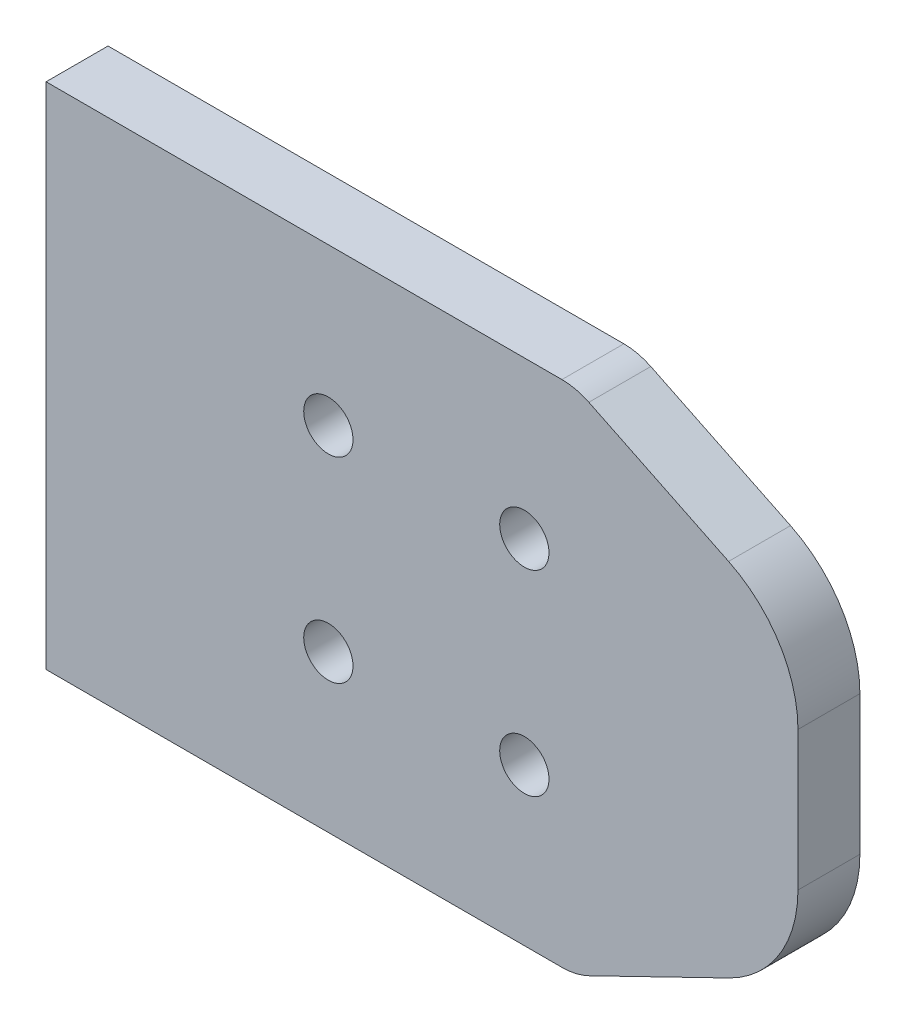
ISO-10303-21;
HEADER;
FILE_DESCRIPTION(('STEP AP214'),'2;1');
FILE_NAME('part.step','',(''),(''),'','','');
FILE_SCHEMA(('AUTOMOTIVE_DESIGN { 1 0 10303 214 1 1 1 1 }'));
ENDSEC;
DATA;
#1=APPLICATION_CONTEXT('core data for automotive mechanical design processes');
#2=APPLICATION_PROTOCOL_DEFINITION('international standard','automotive_design',2000,#1);
#3=PRODUCT_CONTEXT('',#1,'mechanical');
#4=PRODUCT('Part','Part','',(#3));
#5=PRODUCT_RELATED_PRODUCT_CATEGORY('part','',(#4));
#6=PRODUCT_DEFINITION_FORMATION('','',#4);
#7=PRODUCT_DEFINITION_CONTEXT('part definition',#1,'design');
#8=PRODUCT_DEFINITION('design','',#6,#7);
#9=PRODUCT_DEFINITION_SHAPE('','',#8);
#10=(LENGTH_UNIT() NAMED_UNIT(*) SI_UNIT(.MILLI.,.METRE.));
#11=(NAMED_UNIT(*) PLANE_ANGLE_UNIT() SI_UNIT($,.RADIAN.));
#12=(NAMED_UNIT(*) SI_UNIT($,.STERADIAN.) SOLID_ANGLE_UNIT());
#13=UNCERTAINTY_MEASURE_WITH_UNIT(LENGTH_MEASURE(1.E-05),#10,'distance_accuracy_value','');
#14=(GEOMETRIC_REPRESENTATION_CONTEXT(3) GLOBAL_UNCERTAINTY_ASSIGNED_CONTEXT((#13)) GLOBAL_UNIT_ASSIGNED_CONTEXT((#10,
#11,#12)) REPRESENTATION_CONTEXT('',''));
#15=CARTESIAN_POINT('',(0.,0.,0.));
#16=DIRECTION('',(0.,0.,1.));
#17=DIRECTION('',(1.,0.,0.));
#18=AXIS2_PLACEMENT_3D('',#15,#16,#17);
#19=CARTESIAN_POINT('',(-90.9413983771939,34.3761920714684,10.05));
#20=DIRECTION('',(1.,0.,0.));
#21=DIRECTION('',(0.,0.,-1.));
#22=AXIS2_PLACEMENT_3D('',#19,#20,#21);
#23=PLANE('',#22);
#24=DIRECTION('',(0.,-1.,0.));
#25=VECTOR('',#24,1.);
#26=CARTESIAN_POINT('',(-90.9413983771939,34.3761920714684,0.));
#27=LINE('',#26,#25);
#28=CARTESIAN_POINT('',(-90.9413983771939,34.3761920714684,0.));
#29=VERTEX_POINT('',#28);
#30=CARTESIAN_POINT('',(-90.9413983771939,-48.2238079285316,0.));
#31=VERTEX_POINT('',#30);
#32=EDGE_CURVE('E135',#29,#31,#27,.T.);
#33=ORIENTED_EDGE('',*,*,#32,.T.);
#34=DIRECTION('',(0.,0.,-1.));
#35=VECTOR('',#34,1.);
#36=CARTESIAN_POINT('',(-90.9413983771939,-48.2238079285316,10.05));
#37=LINE('',#36,#35);
#38=CARTESIAN_POINT('',(-90.9413983771939,-48.2238079285316,10.05));
#39=VERTEX_POINT('',#38);
#40=EDGE_CURVE('E116',#39,#31,#37,.T.);
#41=ORIENTED_EDGE('',*,*,#40,.F.);
#42=DIRECTION('',(0.,-1.,0.));
#43=VECTOR('',#42,1.);
#44=CARTESIAN_POINT('',(-90.9413983771939,34.3761920714684,10.05));
#45=LINE('',#44,#43);
#46=CARTESIAN_POINT('',(-90.9413983771939,34.3761920714684,10.05));
#47=VERTEX_POINT('',#46);
#48=EDGE_CURVE('E122',#47,#39,#45,.T.);
#49=ORIENTED_EDGE('',*,*,#48,.F.);
#50=DIRECTION('',(0.,0.,-1.));
#51=VECTOR('',#50,1.);
#52=CARTESIAN_POINT('',(-90.9413983771939,34.3761920714684,10.05));
#53=LINE('',#52,#51);
#54=EDGE_CURVE('E137',#47,#29,#53,.T.);
#55=ORIENTED_EDGE('',*,*,#54,.T.);
#56=EDGE_LOOP('',(#33,#41,#49,#55));
#57=FACE_BOUND('',#56,.T.);
#58=ADVANCED_FACE('F31',(#57),#23,.F.);
#59=CARTESIAN_POINT('',(-90.9413983771939,-48.2238079285316,10.05));
#60=DIRECTION('',(0.,1.,0.));
#61=DIRECTION('',(0.,0.,1.));
#62=AXIS2_PLACEMENT_3D('',#59,#60,#61);
#63=PLANE('',#62);
#64=DIRECTION('',(1.,0.,0.));
#65=VECTOR('',#64,1.);
#66=CARTESIAN_POINT('',(-90.9413983771939,-48.2238079285316,0.));
#67=LINE('',#66,#65);
#68=CARTESIAN_POINT('',(-7.2431784453373,-48.2238079285316,0.));
#69=VERTEX_POINT('',#68);
#70=EDGE_CURVE('E222',#31,#69,#67,.T.);
#71=ORIENTED_EDGE('',*,*,#70,.T.);
#72=DIRECTION('',(0.,0.,-1.));
#73=VECTOR('',#72,1.);
#74=CARTESIAN_POINT('',(-7.2431784453373,-48.2238079285316,10.05));
#75=LINE('',#74,#73);
#76=CARTESIAN_POINT('',(-7.2431784453373,-48.2238079285316,10.05));
#77=VERTEX_POINT('',#76);
#78=EDGE_CURVE('E119',#69,#77,#75,.F.);
#79=ORIENTED_EDGE('',*,*,#78,.T.);
#80=DIRECTION('',(1.,0.,0.));
#81=VECTOR('',#80,1.);
#82=CARTESIAN_POINT('',(-90.9413983771939,-48.2238079285316,10.05));
#83=LINE('',#82,#81);
#84=EDGE_CURVE('E111',#39,#77,#83,.T.);
#85=ORIENTED_EDGE('',*,*,#84,.F.);
#86=ORIENTED_EDGE('',*,*,#40,.T.);
#87=EDGE_LOOP('',(#71,#79,#85,#86));
#88=FACE_BOUND('',#87,.T.);
#89=ADVANCED_FACE('F114',(#88),#63,.F.);
#90=CARTESIAN_POINT('',(31.058601622806,34.3761920714684,10.05));
#91=DIRECTION('',(-1.,0.,0.));
#92=DIRECTION('',(0.,-1.,0.));
#93=AXIS2_PLACEMENT_3D('',#90,#91,#92);
#94=PLANE('',#93);
#95=DIRECTION('',(0.,1.,0.));
#96=VECTOR('',#95,1.);
#97=CARTESIAN_POINT('',(31.058601622806,34.3761920714684,10.05));
#98=LINE('',#97,#96);
#99=CARTESIAN_POINT('',(31.0586016228061,-18.2081884178366,10.05));
#100=VERTEX_POINT('',#99);
#101=CARTESIAN_POINT('',(31.0586016228061,4.36057256077351,10.05));
#102=VERTEX_POINT('',#101);
#103=EDGE_CURVE('E121',#100,#102,#98,.T.);
#104=ORIENTED_EDGE('',*,*,#103,.F.);
#105=DIRECTION('',(0.,0.,-1.));
#106=VECTOR('',#105,1.);
#107=CARTESIAN_POINT('',(31.0586016228061,-18.2081884178366,10.05));
#108=LINE('',#107,#106);
#109=CARTESIAN_POINT('',(31.0586016228061,-18.2081884178366,0.));
#110=VERTEX_POINT('',#109);
#111=EDGE_CURVE('E162',#100,#110,#108,.T.);
#112=ORIENTED_EDGE('',*,*,#111,.T.);
#113=DIRECTION('',(0.,1.,0.));
#114=VECTOR('',#113,1.);
#115=CARTESIAN_POINT('',(31.058601622806,34.3761920714684,0.));
#116=LINE('',#115,#114);
#117=CARTESIAN_POINT('',(31.0586016228061,4.36057256077351,0.));
#118=VERTEX_POINT('',#117);
#119=EDGE_CURVE('E186',#110,#118,#116,.T.);
#120=ORIENTED_EDGE('',*,*,#119,.T.);
#121=DIRECTION('',(0.,0.,-1.));
#122=VECTOR('',#121,1.);
#123=CARTESIAN_POINT('',(31.0586016228061,4.3605725607735,10.05));
#124=LINE('',#123,#122);
#125=EDGE_CURVE('E160',#118,#102,#124,.F.);
#126=ORIENTED_EDGE('',*,*,#125,.T.);
#127=EDGE_LOOP('',(#104,#112,#120,#126));
#128=FACE_BOUND('',#127,.T.);
#129=ADVANCED_FACE('F176',(#128),#94,.F.);
#130=CARTESIAN_POINT('',(-90.9413983771939,34.3761920714684,10.05));
#131=DIRECTION('',(0.,-1.,0.));
#132=DIRECTION('',(0.,0.,-1.));
#133=AXIS2_PLACEMENT_3D('',#130,#131,#132);
#134=PLANE('',#133);
#135=DIRECTION('',(-1.,0.,0.));
#136=VECTOR('',#135,1.);
#137=CARTESIAN_POINT('',(-90.9413983771939,34.3761920714684,10.05));
#138=LINE('',#137,#136);
#139=CARTESIAN_POINT('',(-7.24317844533733,34.3761920714684,10.05));
#140=VERTEX_POINT('',#139);
#141=EDGE_CURVE('E128',#140,#47,#138,.T.);
#142=ORIENTED_EDGE('',*,*,#141,.F.);
#143=DIRECTION('',(0.,0.,-1.));
#144=VECTOR('',#143,1.);
#145=CARTESIAN_POINT('',(-7.2431784453373,34.3761920714684,10.05));
#146=LINE('',#145,#144);
#147=CARTESIAN_POINT('',(-7.24317844533733,34.3761920714684,0.));
#148=VERTEX_POINT('',#147);
#149=EDGE_CURVE('E154',#140,#148,#146,.T.);
#150=ORIENTED_EDGE('',*,*,#149,.T.);
#151=DIRECTION('',(-1.,0.,0.));
#152=VECTOR('',#151,1.);
#153=CARTESIAN_POINT('',(-90.9413983771939,34.3761920714684,0.));
#154=LINE('',#153,#152);
#155=EDGE_CURVE('E132',#148,#29,#154,.T.);
#156=ORIENTED_EDGE('',*,*,#155,.T.);
#157=ORIENTED_EDGE('',*,*,#54,.F.);
#158=EDGE_LOOP('',(#142,#150,#156,#157));
#159=FACE_BOUND('',#158,.T.);
#160=ADVANCED_FACE('F226',(#159),#134,.F.);
#161=CARTESIAN_POINT('',(-90.9413983771939,-48.2238079285316,10.05));
#162=DIRECTION('',(0.,0.,1.));
#163=DIRECTION('',(1.,0.,0.));
#164=AXIS2_PLACEMENT_3D('',#161,#162,#163);
#165=PLANE('',#164);
#166=DIRECTION('',(0.899367854138262,0.437192706872767,0.));
#167=VECTOR('',#166,1.);
#168=CARTESIAN_POINT('',(-4.94139837719395,-48.2238079285316,10.05));
#169=LINE('',#168,#167);
#170=CARTESIAN_POINT('',(-2.87125137660963,-47.2174864699142,10.05));
#171=VERTEX_POINT('',#170);
#172=CARTESIAN_POINT('',(19.8024557602614,-36.1955455006019,10.05));
#173=VERTEX_POINT('',#172);
#174=EDGE_CURVE('E172',#171,#173,#169,.T.);
#175=ORIENTED_EDGE('',*,*,#174,.T.);
#176=CARTESIAN_POINT('',(11.0586016228061,-18.2081884178366,10.05));
#177=DIRECTION('',(0.,0.,1.));
#178=DIRECTION('',(1.,0.,0.));
#179=AXIS2_PLACEMENT_3D('',#176,#177,#178);
#180=CIRCLE('',#179,20.);
#181=EDGE_CURVE('E39',#173,#100,#180,.T.);
#182=ORIENTED_EDGE('',*,*,#181,.T.);
#183=ORIENTED_EDGE('',*,*,#103,.T.);
#184=CARTESIAN_POINT('',(11.0586016228061,4.3605725607735,10.05));
#185=DIRECTION('',(0.,0.,1.));
#186=DIRECTION('',(1.,0.,0.));
#187=AXIS2_PLACEMENT_3D('',#184,#185,#186);
#188=CIRCLE('',#187,20.);
#189=CARTESIAN_POINT('',(19.8024557602614,22.3479296435388,10.05));
#190=VERTEX_POINT('',#189);
#191=EDGE_CURVE('E46',#102,#190,#188,.T.);
#192=ORIENTED_EDGE('',*,*,#191,.T.);
#193=DIRECTION('',(-0.899367854138262,0.437192706872767,0.));
#194=VECTOR('',#193,1.);
#195=CARTESIAN_POINT('',(-4.94139837719395,34.3761920714684,10.05));
#196=LINE('',#195,#194);
#197=CARTESIAN_POINT('',(-2.87125137660963,33.3698706128511,10.05));
#198=VERTEX_POINT('',#197);
#199=EDGE_CURVE('E193',#190,#198,#196,.T.);
#200=ORIENTED_EDGE('',*,*,#199,.T.);
#201=CARTESIAN_POINT('',(-7.2431784453373,24.3761920714684,10.05));
#202=DIRECTION('',(0.,0.,1.));
#203=DIRECTION('',(1.,0.,0.));
#204=AXIS2_PLACEMENT_3D('',#201,#202,#203);
#205=CIRCLE('',#204,10.);
#206=EDGE_CURVE('E150',#198,#140,#205,.T.);
#207=ORIENTED_EDGE('',*,*,#206,.T.);
#208=ORIENTED_EDGE('',*,*,#141,.T.);
#209=ORIENTED_EDGE('',*,*,#48,.T.);
#210=ORIENTED_EDGE('',*,*,#84,.T.);
#211=CARTESIAN_POINT('',(-7.2431784453373,-38.2238079285316,10.05));
#212=DIRECTION('',(0.,0.,1.));
#213=DIRECTION('',(1.,0.,0.));
#214=AXIS2_PLACEMENT_3D('',#211,#212,#213);
#215=CIRCLE('',#214,10.);
#216=EDGE_CURVE('E152',#77,#171,#215,.T.);
#217=ORIENTED_EDGE('',*,*,#216,.T.);
#218=EDGE_LOOP('',(#175,#182,#183,#192,#200,#207,#208,#209,#210,#217));
#219=FACE_BOUND('',#218,.T.);
#220=CARTESIAN_POINT('',(-13.3413983771939,-22.8238079285316,10.05));
#221=DIRECTION('',(0.,0.,-1.));
#222=DIRECTION('',(-1.,0.,0.));
#223=AXIS2_PLACEMENT_3D('',#220,#221,#222);
#224=CIRCLE('',#223,4.);
#225=CARTESIAN_POINT('',(-17.3413983771939,-22.8238079285316,10.05));
#226=VERTEX_POINT('',#225);
#227=EDGE_CURVE('E197',#226,#226,#224,.T.);
#228=ORIENTED_EDGE('',*,*,#227,.T.);
#229=EDGE_LOOP('',(#228));
#230=FACE_BOUND('',#229,.T.);
#231=CARTESIAN_POINT('',(-13.3413983771939,8.97619207146843,10.05));
#232=DIRECTION('',(0.,0.,-1.));
#233=DIRECTION('',(-1.,0.,0.));
#234=AXIS2_PLACEMENT_3D('',#231,#232,#233);
#235=CIRCLE('',#234,4.);
#236=CARTESIAN_POINT('',(-17.3413983771939,8.97619207146843,10.05));
#237=VERTEX_POINT('',#236);
#238=EDGE_CURVE('E203',#237,#237,#235,.T.);
#239=ORIENTED_EDGE('',*,*,#238,.T.);
#240=EDGE_LOOP('',(#239));
#241=FACE_BOUND('',#240,.T.);
#242=CARTESIAN_POINT('',(-45.1413983771939,-22.8238079285316,10.05));
#243=DIRECTION('',(0.,0.,-1.));
#244=DIRECTION('',(-1.,0.,0.));
#245=AXIS2_PLACEMENT_3D('',#242,#243,#244);
#246=CIRCLE('',#245,4.);
#247=CARTESIAN_POINT('',(-49.1413983771939,-22.8238079285316,10.05));
#248=VERTEX_POINT('',#247);
#249=EDGE_CURVE('E209',#248,#248,#246,.T.);
#250=ORIENTED_EDGE('',*,*,#249,.T.);
#251=EDGE_LOOP('',(#250));
#252=FACE_BOUND('',#251,.T.);
#253=CARTESIAN_POINT('',(-45.1413983771939,8.97619207146843,10.05));
#254=DIRECTION('',(0.,0.,-1.));
#255=DIRECTION('',(-1.,0.,0.));
#256=AXIS2_PLACEMENT_3D('',#253,#254,#255);
#257=CIRCLE('',#256,4.00000000000001);
#258=CARTESIAN_POINT('',(-49.1413983771939,8.97619207146843,10.05));
#259=VERTEX_POINT('',#258);
#260=EDGE_CURVE('E215',#259,#259,#257,.T.);
#261=ORIENTED_EDGE('',*,*,#260,.T.);
#262=EDGE_LOOP('',(#261));
#263=FACE_BOUND('',#262,.T.);
#264=ADVANCED_FACE('F125',(#219,#230,#241,#252,#263),#165,.T.);
#265=CARTESIAN_POINT('',(-90.9413983771939,-48.2238079285316,0.));
#266=DIRECTION('',(0.,0.,1.));
#267=DIRECTION('',(1.,0.,0.));
#268=AXIS2_PLACEMENT_3D('',#265,#266,#267);
#269=PLANE('',#268);
#270=CARTESIAN_POINT('',(-13.3413983771939,-22.8238079285316,0.));
#271=DIRECTION('',(0.,0.,-1.));
#272=DIRECTION('',(-1.,0.,0.));
#273=AXIS2_PLACEMENT_3D('',#270,#271,#272);
#274=CIRCLE('',#273,4.);
#275=CARTESIAN_POINT('',(-17.3413983771939,-22.8238079285316,0.));
#276=VERTEX_POINT('',#275);
#277=EDGE_CURVE('E195',#276,#276,#274,.T.);
#278=ORIENTED_EDGE('',*,*,#277,.F.);
#279=EDGE_LOOP('',(#278));
#280=FACE_BOUND('',#279,.T.);
#281=CARTESIAN_POINT('',(-13.3413983771939,8.97619207146843,0.));
#282=DIRECTION('',(0.,0.,-1.));
#283=DIRECTION('',(-1.,0.,0.));
#284=AXIS2_PLACEMENT_3D('',#281,#282,#283);
#285=CIRCLE('',#284,4.);
#286=CARTESIAN_POINT('',(-17.3413983771939,8.97619207146843,0.));
#287=VERTEX_POINT('',#286);
#288=EDGE_CURVE('E200',#287,#287,#285,.T.);
#289=ORIENTED_EDGE('',*,*,#288,.F.);
#290=EDGE_LOOP('',(#289));
#291=FACE_BOUND('',#290,.T.);
#292=CARTESIAN_POINT('',(-45.1413983771939,-22.8238079285316,0.));
#293=DIRECTION('',(0.,0.,-1.));
#294=DIRECTION('',(-1.,0.,0.));
#295=AXIS2_PLACEMENT_3D('',#292,#293,#294);
#296=CIRCLE('',#295,4.);
#297=CARTESIAN_POINT('',(-49.1413983771939,-22.8238079285316,0.));
#298=VERTEX_POINT('',#297);
#299=EDGE_CURVE('E206',#298,#298,#296,.T.);
#300=ORIENTED_EDGE('',*,*,#299,.F.);
#301=EDGE_LOOP('',(#300));
#302=FACE_BOUND('',#301,.T.);
#303=CARTESIAN_POINT('',(-45.1413983771939,8.97619207146843,0.));
#304=DIRECTION('',(0.,0.,-1.));
#305=DIRECTION('',(-1.,0.,0.));
#306=AXIS2_PLACEMENT_3D('',#303,#304,#305);
#307=CIRCLE('',#306,4.00000000000001);
#308=CARTESIAN_POINT('',(-49.1413983771939,8.97619207146843,0.));
#309=VERTEX_POINT('',#308);
#310=EDGE_CURVE('E212',#309,#309,#307,.T.);
#311=ORIENTED_EDGE('',*,*,#310,.F.);
#312=EDGE_LOOP('',(#311));
#313=FACE_BOUND('',#312,.T.);
#314=ORIENTED_EDGE('',*,*,#119,.F.);
#315=CARTESIAN_POINT('',(11.0586016228061,-18.2081884178366,0.));
#316=DIRECTION('',(0.,0.,1.));
#317=DIRECTION('',(1.,0.,0.));
#318=AXIS2_PLACEMENT_3D('',#315,#316,#317);
#319=CIRCLE('',#318,20.);
#320=CARTESIAN_POINT('',(19.8024557602614,-36.1955455006019,0.));
#321=VERTEX_POINT('',#320);
#322=EDGE_CURVE('E167',#110,#321,#319,.F.);
#323=ORIENTED_EDGE('',*,*,#322,.T.);
#324=DIRECTION('',(0.899367854138262,0.437192706872767,0.));
#325=VECTOR('',#324,1.);
#326=CARTESIAN_POINT('',(-4.94139837719395,-48.2238079285316,0.));
#327=LINE('',#326,#325);
#328=CARTESIAN_POINT('',(-2.87125137660963,-47.2174864699142,0.));
#329=VERTEX_POINT('',#328);
#330=EDGE_CURVE('E185',#329,#321,#327,.T.);
#331=ORIENTED_EDGE('',*,*,#330,.F.);
#332=CARTESIAN_POINT('',(-7.2431784453373,-38.2238079285316,0.));
#333=DIRECTION('',(0.,0.,1.));
#334=DIRECTION('',(1.,0.,0.));
#335=AXIS2_PLACEMENT_3D('',#332,#333,#334);
#336=CIRCLE('',#335,10.);
#337=EDGE_CURVE('E147',#329,#69,#336,.F.);
#338=ORIENTED_EDGE('',*,*,#337,.T.);
#339=ORIENTED_EDGE('',*,*,#70,.F.);
#340=ORIENTED_EDGE('',*,*,#32,.F.);
#341=ORIENTED_EDGE('',*,*,#155,.F.);
#342=CARTESIAN_POINT('',(-7.2431784453373,24.3761920714684,0.));
#343=DIRECTION('',(0.,0.,1.));
#344=DIRECTION('',(1.,0.,0.));
#345=AXIS2_PLACEMENT_3D('',#342,#343,#344);
#346=CIRCLE('',#345,10.);
#347=CARTESIAN_POINT('',(-2.87125137660963,33.3698706128511,0.));
#348=VERTEX_POINT('',#347);
#349=EDGE_CURVE('E140',#148,#348,#346,.F.);
#350=ORIENTED_EDGE('',*,*,#349,.T.);
#351=DIRECTION('',(-0.899367854138262,0.437192706872767,0.));
#352=VECTOR('',#351,1.);
#353=CARTESIAN_POINT('',(-4.94139837719395,34.3761920714684,0.));
#354=LINE('',#353,#352);
#355=CARTESIAN_POINT('',(19.8024557602614,22.3479296435388,0.));
#356=VERTEX_POINT('',#355);
#357=EDGE_CURVE('E190',#356,#348,#354,.T.);
#358=ORIENTED_EDGE('',*,*,#357,.F.);
#359=CARTESIAN_POINT('',(11.0586016228061,4.3605725607735,0.));
#360=DIRECTION('',(0.,0.,1.));
#361=DIRECTION('',(1.,0.,0.));
#362=AXIS2_PLACEMENT_3D('',#359,#360,#361);
#363=CIRCLE('',#362,20.);
#364=EDGE_CURVE('E165',#356,#118,#363,.F.);
#365=ORIENTED_EDGE('',*,*,#364,.T.);
#366=EDGE_LOOP('',(#314,#323,#331,#338,#339,#340,#341,#350,#358,#365));
#367=FACE_BOUND('',#366,.T.);
#368=ADVANCED_FACE('F184',(#280,#291,#302,#313,#367),#269,.F.);
#369=CARTESIAN_POINT('',(-45.1413983771939,8.97619207146843,10.05));
#370=DIRECTION('',(0.,0.,-1.));
#371=DIRECTION('',(-1.,0.,0.));
#372=AXIS2_PLACEMENT_3D('',#369,#370,#371);
#373=CYLINDRICAL_SURFACE('',#372,4.00000000000001);
#374=ORIENTED_EDGE('',*,*,#260,.F.);
#375=EDGE_LOOP('',(#374));
#376=FACE_BOUND('',#375,.T.);
#377=ORIENTED_EDGE('',*,*,#310,.T.);
#378=EDGE_LOOP('',(#377));
#379=FACE_BOUND('',#378,.T.);
#380=ADVANCED_FACE('F254',(#376,#379),#373,.F.);
#381=CARTESIAN_POINT('',(-45.1413983771939,-22.8238079285316,10.05));
#382=DIRECTION('',(0.,0.,-1.));
#383=DIRECTION('',(-1.,0.,0.));
#384=AXIS2_PLACEMENT_3D('',#381,#382,#383);
#385=CYLINDRICAL_SURFACE('',#384,4.);
#386=ORIENTED_EDGE('',*,*,#249,.F.);
#387=EDGE_LOOP('',(#386));
#388=FACE_BOUND('',#387,.T.);
#389=ORIENTED_EDGE('',*,*,#299,.T.);
#390=EDGE_LOOP('',(#389));
#391=FACE_BOUND('',#390,.T.);
#392=ADVANCED_FACE('F260',(#388,#391),#385,.F.);
#393=CARTESIAN_POINT('',(-13.3413983771939,8.97619207146843,10.05));
#394=DIRECTION('',(0.,0.,-1.));
#395=DIRECTION('',(-1.,0.,0.));
#396=AXIS2_PLACEMENT_3D('',#393,#394,#395);
#397=CYLINDRICAL_SURFACE('',#396,4.);
#398=ORIENTED_EDGE('',*,*,#238,.F.);
#399=EDGE_LOOP('',(#398));
#400=FACE_BOUND('',#399,.T.);
#401=ORIENTED_EDGE('',*,*,#288,.T.);
#402=EDGE_LOOP('',(#401));
#403=FACE_BOUND('',#402,.T.);
#404=ADVANCED_FACE('F264',(#400,#403),#397,.F.);
#405=CARTESIAN_POINT('',(-13.3413983771939,-22.8238079285316,10.05));
#406=DIRECTION('',(0.,0.,-1.));
#407=DIRECTION('',(-1.,0.,0.));
#408=AXIS2_PLACEMENT_3D('',#405,#406,#407);
#409=CYLINDRICAL_SURFACE('',#408,4.);
#410=ORIENTED_EDGE('',*,*,#227,.F.);
#411=EDGE_LOOP('',(#410));
#412=FACE_BOUND('',#411,.T.);
#413=ORIENTED_EDGE('',*,*,#277,.T.);
#414=EDGE_LOOP('',(#413));
#415=FACE_BOUND('',#414,.T.);
#416=ADVANCED_FACE('F268',(#412,#415),#409,.F.);
#417=CARTESIAN_POINT('',(-4.94139837719395,34.3761920714684,10.05));
#418=DIRECTION('',(-0.437192706872767,-0.899367854138263,0.));
#419=DIRECTION('',(0.899367854138263,-0.437192706872767,0.));
#420=AXIS2_PLACEMENT_3D('',#417,#418,#419);
#421=PLANE('',#420);
#422=ORIENTED_EDGE('',*,*,#199,.F.);
#423=DIRECTION('',(0.,0.,-1.));
#424=VECTOR('',#423,1.);
#425=CARTESIAN_POINT('',(19.8024557602614,22.3479296435388,10.05));
#426=LINE('',#425,#424);
#427=EDGE_CURVE('E11',#190,#356,#426,.T.);
#428=ORIENTED_EDGE('',*,*,#427,.T.);
#429=ORIENTED_EDGE('',*,*,#357,.T.);
#430=DIRECTION('',(0.,0.,-1.));
#431=VECTOR('',#430,1.);
#432=CARTESIAN_POINT('',(-2.87125137660963,33.3698706128511,10.05));
#433=LINE('',#432,#431);
#434=EDGE_CURVE('E157',#348,#198,#433,.F.);
#435=ORIENTED_EDGE('',*,*,#434,.T.);
#436=EDGE_LOOP('',(#422,#428,#429,#435));
#437=FACE_BOUND('',#436,.T.);
#438=ADVANCED_FACE('F239',(#437),#421,.F.);
#439=CARTESIAN_POINT('',(-4.94139837719395,-48.2238079285316,10.05));
#440=DIRECTION('',(-0.437192706872767,0.899367854138263,0.));
#441=DIRECTION('',(-0.899367854138263,-0.437192706872767,0.));
#442=AXIS2_PLACEMENT_3D('',#439,#440,#441);
#443=PLANE('',#442);
#444=ORIENTED_EDGE('',*,*,#330,.T.);
#445=DIRECTION('',(0.,0.,-1.));
#446=VECTOR('',#445,1.);
#447=CARTESIAN_POINT('',(19.8024557602614,-36.1955455006019,10.05));
#448=LINE('',#447,#446);
#449=EDGE_CURVE('E54',#321,#173,#448,.F.);
#450=ORIENTED_EDGE('',*,*,#449,.T.);
#451=ORIENTED_EDGE('',*,*,#174,.F.);
#452=DIRECTION('',(0.,0.,-1.));
#453=VECTOR('',#452,1.);
#454=CARTESIAN_POINT('',(-2.87125137660963,-47.2174864699142,10.05));
#455=LINE('',#454,#453);
#456=EDGE_CURVE('E136',#171,#329,#455,.T.);
#457=ORIENTED_EDGE('',*,*,#456,.T.);
#458=EDGE_LOOP('',(#444,#450,#451,#457));
#459=FACE_BOUND('',#458,.T.);
#460=ADVANCED_FACE('F187',(#459),#443,.F.);
#461=CARTESIAN_POINT('',(-7.2431784453373,-38.2238079285316,10.05));
#462=DIRECTION('',(0.,0.,-1.));
#463=DIRECTION('',(-1.,0.,0.));
#464=AXIS2_PLACEMENT_3D('',#461,#462,#463);
#465=CYLINDRICAL_SURFACE('',#464,10.);
#466=ORIENTED_EDGE('',*,*,#216,.F.);
#467=ORIENTED_EDGE('',*,*,#78,.F.);
#468=ORIENTED_EDGE('',*,*,#337,.F.);
#469=ORIENTED_EDGE('',*,*,#456,.F.);
#470=EDGE_LOOP('',(#466,#467,#468,#469));
#471=FACE_BOUND('',#470,.T.);
#472=ADVANCED_FACE('F229',(#471),#465,.T.);
#473=CARTESIAN_POINT('',(-7.2431784453373,24.3761920714684,10.05));
#474=DIRECTION('',(0.,0.,-1.));
#475=DIRECTION('',(-1.,0.,0.));
#476=AXIS2_PLACEMENT_3D('',#473,#474,#475);
#477=CYLINDRICAL_SURFACE('',#476,10.);
#478=ORIENTED_EDGE('',*,*,#206,.F.);
#479=ORIENTED_EDGE('',*,*,#434,.F.);
#480=ORIENTED_EDGE('',*,*,#349,.F.);
#481=ORIENTED_EDGE('',*,*,#149,.F.);
#482=EDGE_LOOP('',(#478,#479,#480,#481));
#483=FACE_BOUND('',#482,.T.);
#484=ADVANCED_FACE('F231',(#483),#477,.T.);
#485=CARTESIAN_POINT('',(11.0586016228061,-18.2081884178366,10.05));
#486=DIRECTION('',(0.,0.,-1.));
#487=DIRECTION('',(-1.,0.,0.));
#488=AXIS2_PLACEMENT_3D('',#485,#486,#487);
#489=CYLINDRICAL_SURFACE('',#488,20.);
#490=ORIENTED_EDGE('',*,*,#181,.F.);
#491=ORIENTED_EDGE('',*,*,#449,.F.);
#492=ORIENTED_EDGE('',*,*,#322,.F.);
#493=ORIENTED_EDGE('',*,*,#111,.F.);
#494=EDGE_LOOP('',(#490,#491,#492,#493));
#495=FACE_BOUND('',#494,.T.);
#496=ADVANCED_FACE('F181',(#495),#489,.T.);
#497=CARTESIAN_POINT('',(11.0586016228061,4.3605725607735,10.05));
#498=DIRECTION('',(0.,0.,-1.));
#499=DIRECTION('',(-1.,0.,0.));
#500=AXIS2_PLACEMENT_3D('',#497,#498,#499);
#501=CYLINDRICAL_SURFACE('',#500,20.);
#502=ORIENTED_EDGE('',*,*,#191,.F.);
#503=ORIENTED_EDGE('',*,*,#125,.F.);
#504=ORIENTED_EDGE('',*,*,#364,.F.);
#505=ORIENTED_EDGE('',*,*,#427,.F.);
#506=EDGE_LOOP('',(#502,#503,#504,#505));
#507=FACE_BOUND('',#506,.T.);
#508=ADVANCED_FACE('F33',(#507),#501,.T.);
#509=CLOSED_SHELL('',(#58,#89,#129,#160,#264,#368,#380,#392,#404,#416,#438,#460,#472,#484,#496,#508));
#510=MANIFOLD_SOLID_BREP('B2',#509);
#511=ADVANCED_BREP_SHAPE_REPRESENTATION('',(#18,#510),#14);
#512=SHAPE_DEFINITION_REPRESENTATION(#9,#511);
ENDSEC;
END-ISO-10303-21;
